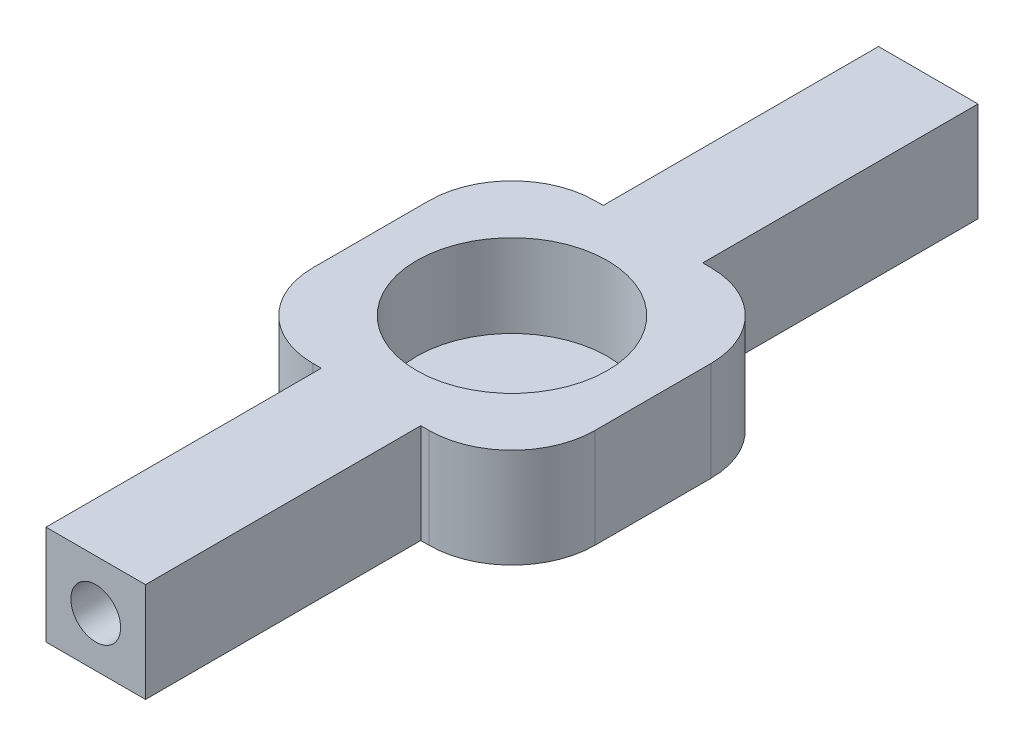
ISO-10303-21;
HEADER;
FILE_DESCRIPTION(('STEP AP214'),'2;1');
FILE_NAME('part.step','',(''),(''),'','','');
FILE_SCHEMA(('AUTOMOTIVE_DESIGN { 1 0 10303 214 1 1 1 1 }'));
ENDSEC;
DATA;
#1=APPLICATION_CONTEXT('core data for automotive mechanical design processes');
#2=APPLICATION_PROTOCOL_DEFINITION('international standard','automotive_design',2000,#1);
#3=PRODUCT_CONTEXT('',#1,'mechanical');
#4=PRODUCT('Part','Part','',(#3));
#5=PRODUCT_RELATED_PRODUCT_CATEGORY('part','',(#4));
#6=PRODUCT_DEFINITION_FORMATION('','',#4);
#7=PRODUCT_DEFINITION_CONTEXT('part definition',#1,'design');
#8=PRODUCT_DEFINITION('design','',#6,#7);
#9=PRODUCT_DEFINITION_SHAPE('','',#8);
#10=(LENGTH_UNIT() NAMED_UNIT(*) SI_UNIT(.MILLI.,.METRE.));
#11=(NAMED_UNIT(*) PLANE_ANGLE_UNIT() SI_UNIT($,.RADIAN.));
#12=(NAMED_UNIT(*) SI_UNIT($,.STERADIAN.) SOLID_ANGLE_UNIT());
#13=UNCERTAINTY_MEASURE_WITH_UNIT(LENGTH_MEASURE(1.E-05),#10,'distance_accuracy_value','');
#14=(GEOMETRIC_REPRESENTATION_CONTEXT(3) GLOBAL_UNCERTAINTY_ASSIGNED_CONTEXT((#13)) GLOBAL_UNIT_ASSIGNED_CONTEXT((#10,
#11,#12)) REPRESENTATION_CONTEXT('',''));
#15=CARTESIAN_POINT('',(0.,0.,0.));
#16=DIRECTION('',(0.,0.,1.));
#17=DIRECTION('',(1.,0.,0.));
#18=AXIS2_PLACEMENT_3D('',#15,#16,#17);
#19=CARTESIAN_POINT('',(0.,6.,0.));
#20=DIRECTION('',(0.,-1.,0.));
#21=DIRECTION('',(0.,0.,-1.));
#22=AXIS2_PLACEMENT_3D('',#19,#20,#21);
#23=PLANE('',#22);
#24=DIRECTION('',(-1.,0.,0.));
#25=VECTOR('',#24,1.);
#26=CARTESIAN_POINT('',(8.5,6.,8.5));
#27=LINE('',#26,#25);
#28=CARTESIAN_POINT('',(3.50000000000001,6.,8.5));
#29=VERTEX_POINT('',#28);
#30=CARTESIAN_POINT('',(3.,6.,8.5));
#31=VERTEX_POINT('',#30);
#32=EDGE_CURVE('E197',#29,#31,#27,.T.);
#33=ORIENTED_EDGE('',*,*,#32,.F.);
#34=CARTESIAN_POINT('',(3.5,6.,3.5));
#35=DIRECTION('',(0.,-1.,0.));
#36=DIRECTION('',(0.,0.,-1.));
#37=AXIS2_PLACEMENT_3D('',#34,#35,#36);
#38=CIRCLE('',#37,5.);
#39=CARTESIAN_POINT('',(8.5,6.,3.5));
#40=VERTEX_POINT('',#39);
#41=EDGE_CURVE('E270',#29,#40,#38,.F.);
#42=ORIENTED_EDGE('',*,*,#41,.T.);
#43=DIRECTION('',(0.,0.,1.));
#44=VECTOR('',#43,1.);
#45=CARTESIAN_POINT('',(8.5,6.,-8.5));
#46=LINE('',#45,#44);
#47=CARTESIAN_POINT('',(8.5,6.,-3.5));
#48=VERTEX_POINT('',#47);
#49=EDGE_CURVE('E209',#48,#40,#46,.T.);
#50=ORIENTED_EDGE('',*,*,#49,.F.);
#51=CARTESIAN_POINT('',(3.5,6.,-3.5));
#52=DIRECTION('',(0.,-1.,0.));
#53=DIRECTION('',(0.,0.,-1.));
#54=AXIS2_PLACEMENT_3D('',#51,#52,#53);
#55=CIRCLE('',#54,5.);
#56=CARTESIAN_POINT('',(3.5,6.,-8.5));
#57=VERTEX_POINT('',#56);
#58=EDGE_CURVE('E265',#48,#57,#55,.F.);
#59=ORIENTED_EDGE('',*,*,#58,.T.);
#60=DIRECTION('',(-1.,0.,0.));
#61=VECTOR('',#60,1.);
#62=CARTESIAN_POINT('',(8.5,6.,-8.5));
#63=LINE('',#62,#61);
#64=CARTESIAN_POINT('',(3.,6.,-8.5));
#65=VERTEX_POINT('',#64);
#66=EDGE_CURVE('E226',#57,#65,#63,.T.);
#67=ORIENTED_EDGE('',*,*,#66,.T.);
#68=DIRECTION('',(0.,0.,1.));
#69=VECTOR('',#68,1.);
#70=CARTESIAN_POINT('',(3.,6.,-25.1));
#71=LINE('',#70,#69);
#72=CARTESIAN_POINT('',(3.,6.,-25.1));
#73=VERTEX_POINT('',#72);
#74=EDGE_CURVE('E232',#73,#65,#71,.T.);
#75=ORIENTED_EDGE('',*,*,#74,.F.);
#76=DIRECTION('',(1.,0.,0.));
#77=VECTOR('',#76,1.);
#78=CARTESIAN_POINT('',(-3.,6.,-25.1));
#79=LINE('',#78,#77);
#80=CARTESIAN_POINT('',(-3.,6.,-25.1));
#81=VERTEX_POINT('',#80);
#82=EDGE_CURVE('E366',#81,#73,#79,.T.);
#83=ORIENTED_EDGE('',*,*,#82,.F.);
#84=DIRECTION('',(0.,0.,1.));
#85=VECTOR('',#84,1.);
#86=CARTESIAN_POINT('',(-3.,6.,-25.1));
#87=LINE('',#86,#85);
#88=CARTESIAN_POINT('',(-3.,6.,-8.5));
#89=VERTEX_POINT('',#88);
#90=EDGE_CURVE('E374',#81,#89,#87,.T.);
#91=ORIENTED_EDGE('',*,*,#90,.T.);
#92=DIRECTION('',(-1.,0.,0.));
#93=VECTOR('',#92,1.);
#94=CARTESIAN_POINT('',(-3.,6.,-8.5));
#95=LINE('',#94,#93);
#96=CARTESIAN_POINT('',(-3.5,6.,-8.5));
#97=VERTEX_POINT('',#96);
#98=EDGE_CURVE('E418',#89,#97,#95,.T.);
#99=ORIENTED_EDGE('',*,*,#98,.T.);
#100=CARTESIAN_POINT('',(-3.5,6.,-3.5));
#101=DIRECTION('',(0.,-1.,0.));
#102=DIRECTION('',(0.,0.,-1.));
#103=AXIS2_PLACEMENT_3D('',#100,#101,#102);
#104=CIRCLE('',#103,5.);
#105=CARTESIAN_POINT('',(-8.5,6.,-3.5));
#106=VERTEX_POINT('',#105);
#107=EDGE_CURVE('E262',#97,#106,#104,.F.);
#108=ORIENTED_EDGE('',*,*,#107,.T.);
#109=DIRECTION('',(0.,0.,1.));
#110=VECTOR('',#109,1.);
#111=CARTESIAN_POINT('',(-8.5,6.,-8.5));
#112=LINE('',#111,#110);
#113=CARTESIAN_POINT('',(-8.5,6.,3.5));
#114=VERTEX_POINT('',#113);
#115=EDGE_CURVE('E415',#106,#114,#112,.T.);
#116=ORIENTED_EDGE('',*,*,#115,.T.);
#117=CARTESIAN_POINT('',(-3.5,6.,3.5));
#118=DIRECTION('',(0.,-1.,0.));
#119=DIRECTION('',(0.,0.,-1.));
#120=AXIS2_PLACEMENT_3D('',#117,#118,#119);
#121=CIRCLE('',#120,5.);
#122=CARTESIAN_POINT('',(-3.49999999999999,6.,8.5));
#123=VERTEX_POINT('',#122);
#124=EDGE_CURVE('E97',#114,#123,#121,.F.);
#125=ORIENTED_EDGE('',*,*,#124,.T.);
#126=DIRECTION('',(-1.,0.,0.));
#127=VECTOR('',#126,1.);
#128=CARTESIAN_POINT('',(-3.,6.,8.5));
#129=LINE('',#128,#127);
#130=CARTESIAN_POINT('',(-3.,6.,8.5));
#131=VERTEX_POINT('',#130);
#132=EDGE_CURVE('E412',#131,#123,#129,.T.);
#133=ORIENTED_EDGE('',*,*,#132,.F.);
#134=DIRECTION('',(0.,0.,-1.));
#135=VECTOR('',#134,1.);
#136=CARTESIAN_POINT('',(-2.99999999999999,6.,25.1));
#137=LINE('',#136,#135);
#138=CARTESIAN_POINT('',(-2.99999999999999,6.,25.1));
#139=VERTEX_POINT('',#138);
#140=EDGE_CURVE('E409',#139,#131,#137,.T.);
#141=ORIENTED_EDGE('',*,*,#140,.F.);
#142=DIRECTION('',(1.,0.,0.));
#143=VECTOR('',#142,1.);
#144=CARTESIAN_POINT('',(-2.99999999999999,6.,25.1));
#145=LINE('',#144,#143);
#146=CARTESIAN_POINT('',(2.99999999999999,6.,25.1));
#147=VERTEX_POINT('',#146);
#148=EDGE_CURVE('E215',#139,#147,#145,.T.);
#149=ORIENTED_EDGE('',*,*,#148,.T.);
#150=DIRECTION('',(0.,0.,-1.));
#151=VECTOR('',#150,1.);
#152=CARTESIAN_POINT('',(2.99999999999999,6.,25.1));
#153=LINE('',#152,#151);
#154=EDGE_CURVE('E208',#147,#31,#153,.T.);
#155=ORIENTED_EDGE('',*,*,#154,.T.);
#156=EDGE_LOOP('',(#33,#42,#50,#59,#67,#75,#83,#91,#99,#108,#116,#125,#133,#141,#149,#155));
#157=FACE_BOUND('',#156,.T.);
#158=CARTESIAN_POINT('',(0.,6.,0.));
#159=DIRECTION('',(0.,1.,0.));
#160=DIRECTION('',(0.,0.,1.));
#161=AXIS2_PLACEMENT_3D('',#158,#159,#160);
#162=CIRCLE('',#161,5.75);
#163=CARTESIAN_POINT('',(0.,6.,5.75));
#164=VERTEX_POINT('',#163);
#165=EDGE_CURVE('E382',#164,#164,#162,.T.);
#166=ORIENTED_EDGE('',*,*,#165,.F.);
#167=EDGE_LOOP('',(#166));
#168=FACE_BOUND('',#167,.T.);
#169=ADVANCED_FACE('F81',(#157,#168),#23,.F.);
#170=CARTESIAN_POINT('',(0.,0.,0.));
#171=DIRECTION('',(0.,-1.,0.));
#172=DIRECTION('',(0.,0.,-1.));
#173=AXIS2_PLACEMENT_3D('',#170,#171,#172);
#174=PLANE('',#173);
#175=DIRECTION('',(0.,0.,1.));
#176=VECTOR('',#175,1.);
#177=CARTESIAN_POINT('',(8.5,0.,-8.5));
#178=LINE('',#177,#176);
#179=CARTESIAN_POINT('',(8.5,0.,-3.5));
#180=VERTEX_POINT('',#179);
#181=CARTESIAN_POINT('',(8.5,0.,3.5));
#182=VERTEX_POINT('',#181);
#183=EDGE_CURVE('E378',#180,#182,#178,.T.);
#184=ORIENTED_EDGE('',*,*,#183,.T.);
#185=CARTESIAN_POINT('',(3.5,0.,3.5));
#186=DIRECTION('',(0.,-1.,0.));
#187=DIRECTION('',(0.,0.,-1.));
#188=AXIS2_PLACEMENT_3D('',#185,#186,#187);
#189=CIRCLE('',#188,5.);
#190=CARTESIAN_POINT('',(3.50000000000001,0.,8.5));
#191=VERTEX_POINT('',#190);
#192=EDGE_CURVE('E257',#182,#191,#189,.T.);
#193=ORIENTED_EDGE('',*,*,#192,.T.);
#194=DIRECTION('',(-1.,0.,0.));
#195=VECTOR('',#194,1.);
#196=CARTESIAN_POINT('',(8.5,0.,8.5));
#197=LINE('',#196,#195);
#198=CARTESIAN_POINT('',(3.,0.,8.5));
#199=VERTEX_POINT('',#198);
#200=EDGE_CURVE('E381',#191,#199,#197,.T.);
#201=ORIENTED_EDGE('',*,*,#200,.T.);
#202=DIRECTION('',(0.,0.,-1.));
#203=VECTOR('',#202,1.);
#204=CARTESIAN_POINT('',(2.99999999999999,0.,25.1));
#205=LINE('',#204,#203);
#206=CARTESIAN_POINT('',(2.99999999999999,0.,25.1));
#207=VERTEX_POINT('',#206);
#208=EDGE_CURVE('E223',#207,#199,#205,.T.);
#209=ORIENTED_EDGE('',*,*,#208,.F.);
#210=DIRECTION('',(1.,0.,0.));
#211=VECTOR('',#210,1.);
#212=CARTESIAN_POINT('',(-2.99999999999999,0.,25.1));
#213=LINE('',#212,#211);
#214=CARTESIAN_POINT('',(-2.99999999999999,0.,25.1));
#215=VERTEX_POINT('',#214);
#216=EDGE_CURVE('E329',#215,#207,#213,.T.);
#217=ORIENTED_EDGE('',*,*,#216,.F.);
#218=DIRECTION('',(0.,0.,-1.));
#219=VECTOR('',#218,1.);
#220=CARTESIAN_POINT('',(-2.99999999999999,0.,25.1));
#221=LINE('',#220,#219);
#222=CARTESIAN_POINT('',(-3.,0.,8.5));
#223=VERTEX_POINT('',#222);
#224=EDGE_CURVE('E335',#215,#223,#221,.T.);
#225=ORIENTED_EDGE('',*,*,#224,.T.);
#226=DIRECTION('',(-1.,0.,0.));
#227=VECTOR('',#226,1.);
#228=CARTESIAN_POINT('',(-3.,0.,8.5));
#229=LINE('',#228,#227);
#230=CARTESIAN_POINT('',(-3.49999999999999,0.,8.5));
#231=VERTEX_POINT('',#230);
#232=EDGE_CURVE('E341',#223,#231,#229,.T.);
#233=ORIENTED_EDGE('',*,*,#232,.T.);
#234=CARTESIAN_POINT('',(-3.5,0.,3.5));
#235=DIRECTION('',(0.,-1.,0.));
#236=DIRECTION('',(0.,0.,-1.));
#237=AXIS2_PLACEMENT_3D('',#234,#235,#236);
#238=CIRCLE('',#237,5.);
#239=CARTESIAN_POINT('',(-8.5,0.,3.5));
#240=VERTEX_POINT('',#239);
#241=EDGE_CURVE('E254',#231,#240,#238,.T.);
#242=ORIENTED_EDGE('',*,*,#241,.T.);
#243=DIRECTION('',(0.,0.,1.));
#244=VECTOR('',#243,1.);
#245=CARTESIAN_POINT('',(-8.5,0.,-8.5));
#246=LINE('',#245,#244);
#247=CARTESIAN_POINT('',(-8.5,0.,-3.5));
#248=VERTEX_POINT('',#247);
#249=EDGE_CURVE('E344',#248,#240,#246,.T.);
#250=ORIENTED_EDGE('',*,*,#249,.F.);
#251=CARTESIAN_POINT('',(-3.5,0.,-3.5));
#252=DIRECTION('',(0.,-1.,0.));
#253=DIRECTION('',(0.,0.,-1.));
#254=AXIS2_PLACEMENT_3D('',#251,#252,#253);
#255=CIRCLE('',#254,5.);
#256=CARTESIAN_POINT('',(-3.5,0.,-8.5));
#257=VERTEX_POINT('',#256);
#258=EDGE_CURVE('E248',#248,#257,#255,.T.);
#259=ORIENTED_EDGE('',*,*,#258,.T.);
#260=DIRECTION('',(-1.,0.,0.));
#261=VECTOR('',#260,1.);
#262=CARTESIAN_POINT('',(-3.,0.,-8.5));
#263=LINE('',#262,#261);
#264=CARTESIAN_POINT('',(-3.,0.,-8.5));
#265=VERTEX_POINT('',#264);
#266=EDGE_CURVE('E350',#265,#257,#263,.T.);
#267=ORIENTED_EDGE('',*,*,#266,.F.);
#268=DIRECTION('',(0.,0.,1.));
#269=VECTOR('',#268,1.);
#270=CARTESIAN_POINT('',(-3.,0.,-25.1));
#271=LINE('',#270,#269);
#272=CARTESIAN_POINT('',(-3.,0.,-25.1));
#273=VERTEX_POINT('',#272);
#274=EDGE_CURVE('E354',#273,#265,#271,.T.);
#275=ORIENTED_EDGE('',*,*,#274,.F.);
#276=DIRECTION('',(1.,0.,0.));
#277=VECTOR('',#276,1.);
#278=CARTESIAN_POINT('',(-3.,0.,-25.1));
#279=LINE('',#278,#277);
#280=CARTESIAN_POINT('',(3.,0.,-25.1));
#281=VERTEX_POINT('',#280);
#282=EDGE_CURVE('E308',#273,#281,#279,.T.);
#283=ORIENTED_EDGE('',*,*,#282,.T.);
#284=DIRECTION('',(0.,0.,1.));
#285=VECTOR('',#284,1.);
#286=CARTESIAN_POINT('',(3.,0.,-25.1));
#287=LINE('',#286,#285);
#288=CARTESIAN_POINT('',(3.,0.,-8.5));
#289=VERTEX_POINT('',#288);
#290=EDGE_CURVE('E301',#281,#289,#287,.T.);
#291=ORIENTED_EDGE('',*,*,#290,.T.);
#292=DIRECTION('',(-1.,0.,0.));
#293=VECTOR('',#292,1.);
#294=CARTESIAN_POINT('',(8.5,0.,-8.5));
#295=LINE('',#294,#293);
#296=CARTESIAN_POINT('',(3.5,0.,-8.5));
#297=VERTEX_POINT('',#296);
#298=EDGE_CURVE('E290',#297,#289,#295,.T.);
#299=ORIENTED_EDGE('',*,*,#298,.F.);
#300=CARTESIAN_POINT('',(3.5,0.,-3.5));
#301=DIRECTION('',(0.,-1.,0.));
#302=DIRECTION('',(0.,0.,-1.));
#303=AXIS2_PLACEMENT_3D('',#300,#301,#302);
#304=CIRCLE('',#303,5.);
#305=EDGE_CURVE('E251',#297,#180,#304,.T.);
#306=ORIENTED_EDGE('',*,*,#305,.T.);
#307=EDGE_LOOP('',(#184,#193,#201,#209,#217,#225,#233,#242,#250,#259,#267,#275,#283,#291,#299,#306));
#308=FACE_BOUND('',#307,.T.);
#309=ADVANCED_FACE('F297',(#308),#174,.T.);
#310=CARTESIAN_POINT('',(8.5,6.,-8.5));
#311=DIRECTION('',(1.,0.,0.));
#312=DIRECTION('',(0.,0.,-1.));
#313=AXIS2_PLACEMENT_3D('',#310,#311,#312);
#314=PLANE('',#313);
#315=ORIENTED_EDGE('',*,*,#49,.T.);
#316=DIRECTION('',(0.,-1.,0.));
#317=VECTOR('',#316,1.);
#318=CARTESIAN_POINT('',(8.5,6.,3.5));
#319=LINE('',#318,#317);
#320=EDGE_CURVE('E244',#40,#182,#319,.T.);
#321=ORIENTED_EDGE('',*,*,#320,.T.);
#322=ORIENTED_EDGE('',*,*,#183,.F.);
#323=DIRECTION('',(0.,-1.,0.));
#324=VECTOR('',#323,1.);
#325=CARTESIAN_POINT('',(8.5,6.,-3.5));
#326=LINE('',#325,#324);
#327=EDGE_CURVE('E240',#180,#48,#326,.F.);
#328=ORIENTED_EDGE('',*,*,#327,.T.);
#329=EDGE_LOOP('',(#315,#321,#322,#328));
#330=FACE_BOUND('',#329,.T.);
#331=ADVANCED_FACE('F452',(#330),#314,.T.);
#332=CARTESIAN_POINT('',(8.5,6.,-8.5));
#333=DIRECTION('',(0.,0.,1.));
#334=DIRECTION('',(1.,0.,0.));
#335=AXIS2_PLACEMENT_3D('',#332,#333,#334);
#336=PLANE('',#335);
#337=ORIENTED_EDGE('',*,*,#66,.F.);
#338=DIRECTION('',(0.,-1.,0.));
#339=VECTOR('',#338,1.);
#340=CARTESIAN_POINT('',(3.5,0.,-8.5));
#341=LINE('',#340,#339);
#342=EDGE_CURVE('E90',#57,#297,#341,.T.);
#343=ORIENTED_EDGE('',*,*,#342,.T.);
#344=ORIENTED_EDGE('',*,*,#298,.T.);
#345=DIRECTION('',(0.,-1.,0.));
#346=VECTOR('',#345,1.);
#347=CARTESIAN_POINT('',(3.,6.,-8.5));
#348=LINE('',#347,#346);
#349=EDGE_CURVE('E241',#65,#289,#348,.T.);
#350=ORIENTED_EDGE('',*,*,#349,.F.);
#351=EDGE_LOOP('',(#337,#343,#344,#350));
#352=FACE_BOUND('',#351,.T.);
#353=ADVANCED_FACE('F288',(#352),#336,.F.);
#354=CARTESIAN_POINT('',(3.,6.,-25.1));
#355=DIRECTION('',(1.,0.,0.));
#356=DIRECTION('',(0.,0.,-1.));
#357=AXIS2_PLACEMENT_3D('',#354,#355,#356);
#358=PLANE('',#357);
#359=ORIENTED_EDGE('',*,*,#290,.F.);
#360=DIRECTION('',(0.,-1.,0.));
#361=VECTOR('',#360,1.);
#362=CARTESIAN_POINT('',(3.,6.,-25.1));
#363=LINE('',#362,#361);
#364=EDGE_CURVE('E314',#73,#281,#363,.T.);
#365=ORIENTED_EDGE('',*,*,#364,.F.);
#366=ORIENTED_EDGE('',*,*,#74,.T.);
#367=ORIENTED_EDGE('',*,*,#349,.T.);
#368=EDGE_LOOP('',(#359,#365,#366,#367));
#369=FACE_BOUND('',#368,.T.);
#370=ADVANCED_FACE('F370',(#369),#358,.T.);
#371=CARTESIAN_POINT('',(-3.,6.,-25.1));
#372=DIRECTION('',(0.,0.,-1.));
#373=DIRECTION('',(-1.,0.,0.));
#374=AXIS2_PLACEMENT_3D('',#371,#372,#373);
#375=PLANE('',#374);
#376=CARTESIAN_POINT('',(0.,3.,-25.1));
#377=DIRECTION('',(0.,0.,-1.));
#378=DIRECTION('',(-1.,0.,0.));
#379=AXIS2_PLACEMENT_3D('',#376,#377,#378);
#380=CIRCLE('',#379,1.5);
#381=CARTESIAN_POINT('',(-1.5,3.,-25.1));
#382=VERTEX_POINT('',#381);
#383=EDGE_CURVE('E392',#382,#382,#380,.T.);
#384=ORIENTED_EDGE('',*,*,#383,.F.);
#385=EDGE_LOOP('',(#384));
#386=FACE_BOUND('',#385,.T.);
#387=ORIENTED_EDGE('',*,*,#282,.F.);
#388=DIRECTION('',(0.,-1.,0.));
#389=VECTOR('',#388,1.);
#390=CARTESIAN_POINT('',(-3.,6.,-25.1));
#391=LINE('',#390,#389);
#392=EDGE_CURVE('E317',#81,#273,#391,.T.);
#393=ORIENTED_EDGE('',*,*,#392,.F.);
#394=ORIENTED_EDGE('',*,*,#82,.T.);
#395=ORIENTED_EDGE('',*,*,#364,.T.);
#396=EDGE_LOOP('',(#387,#393,#394,#395));
#397=FACE_BOUND('',#396,.T.);
#398=ADVANCED_FACE('F362',(#386,#397),#375,.T.);
#399=CARTESIAN_POINT('',(-3.,6.,-25.1));
#400=DIRECTION('',(1.,0.,0.));
#401=DIRECTION('',(0.,0.,-1.));
#402=AXIS2_PLACEMENT_3D('',#399,#400,#401);
#403=PLANE('',#402);
#404=ORIENTED_EDGE('',*,*,#274,.T.);
#405=DIRECTION('',(0.,-1.,0.));
#406=VECTOR('',#405,1.);
#407=CARTESIAN_POINT('',(-3.,6.,-8.5));
#408=LINE('',#407,#406);
#409=EDGE_CURVE('E320',#89,#265,#408,.T.);
#410=ORIENTED_EDGE('',*,*,#409,.F.);
#411=ORIENTED_EDGE('',*,*,#90,.F.);
#412=ORIENTED_EDGE('',*,*,#392,.T.);
#413=EDGE_LOOP('',(#404,#410,#411,#412));
#414=FACE_BOUND('',#413,.T.);
#415=ADVANCED_FACE('F426',(#414),#403,.F.);
#416=CARTESIAN_POINT('',(-3.,6.,-8.5));
#417=DIRECTION('',(0.,0.,1.));
#418=DIRECTION('',(1.,0.,0.));
#419=AXIS2_PLACEMENT_3D('',#416,#417,#418);
#420=PLANE('',#419);
#421=ORIENTED_EDGE('',*,*,#266,.T.);
#422=DIRECTION('',(0.,-1.,0.));
#423=VECTOR('',#422,1.);
#424=CARTESIAN_POINT('',(-3.5,6.,-8.5));
#425=LINE('',#424,#423);
#426=EDGE_CURVE('E12',#257,#97,#425,.F.);
#427=ORIENTED_EDGE('',*,*,#426,.T.);
#428=ORIENTED_EDGE('',*,*,#98,.F.);
#429=ORIENTED_EDGE('',*,*,#409,.T.);
#430=EDGE_LOOP('',(#421,#427,#428,#429));
#431=FACE_BOUND('',#430,.T.);
#432=ADVANCED_FACE('F428',(#431),#420,.F.);
#433=CARTESIAN_POINT('',(-8.5,6.,-8.5));
#434=DIRECTION('',(1.,0.,0.));
#435=DIRECTION('',(0.,0.,-1.));
#436=AXIS2_PLACEMENT_3D('',#433,#434,#435);
#437=PLANE('',#436);
#438=ORIENTED_EDGE('',*,*,#249,.T.);
#439=DIRECTION('',(0.,-1.,0.));
#440=VECTOR('',#439,1.);
#441=CARTESIAN_POINT('',(-8.5,6.,3.5));
#442=LINE('',#441,#440);
#443=EDGE_CURVE('E105',#240,#114,#442,.F.);
#444=ORIENTED_EDGE('',*,*,#443,.T.);
#445=ORIENTED_EDGE('',*,*,#115,.F.);
#446=DIRECTION('',(0.,-1.,0.));
#447=VECTOR('',#446,1.);
#448=CARTESIAN_POINT('',(-8.5,6.,-3.5));
#449=LINE('',#448,#447);
#450=EDGE_CURVE('E277',#106,#248,#449,.T.);
#451=ORIENTED_EDGE('',*,*,#450,.T.);
#452=EDGE_LOOP('',(#438,#444,#445,#451));
#453=FACE_BOUND('',#452,.T.);
#454=ADVANCED_FACE('F432',(#453),#437,.F.);
#455=CARTESIAN_POINT('',(-3.,6.,8.5));
#456=DIRECTION('',(0.,0.,1.));
#457=DIRECTION('',(1.,0.,0.));
#458=AXIS2_PLACEMENT_3D('',#455,#456,#457);
#459=PLANE('',#458);
#460=ORIENTED_EDGE('',*,*,#132,.T.);
#461=DIRECTION('',(0.,-1.,0.));
#462=VECTOR('',#461,1.);
#463=CARTESIAN_POINT('',(-3.49999999999999,0.,8.5));
#464=LINE('',#463,#462);
#465=EDGE_CURVE('E273',#123,#231,#464,.T.);
#466=ORIENTED_EDGE('',*,*,#465,.T.);
#467=ORIENTED_EDGE('',*,*,#232,.F.);
#468=DIRECTION('',(0.,-1.,0.));
#469=VECTOR('',#468,1.);
#470=CARTESIAN_POINT('',(-3.,6.,8.5));
#471=LINE('',#470,#469);
#472=EDGE_CURVE('E323',#131,#223,#471,.T.);
#473=ORIENTED_EDGE('',*,*,#472,.F.);
#474=EDGE_LOOP('',(#460,#466,#467,#473));
#475=FACE_BOUND('',#474,.T.);
#476=ADVANCED_FACE('F438',(#475),#459,.T.);
#477=CARTESIAN_POINT('',(-2.99999999999999,6.,25.1));
#478=DIRECTION('',(-1.,0.,0.));
#479=DIRECTION('',(0.,0.,1.));
#480=AXIS2_PLACEMENT_3D('',#477,#478,#479);
#481=PLANE('',#480);
#482=ORIENTED_EDGE('',*,*,#224,.F.);
#483=DIRECTION('',(0.,-1.,0.));
#484=VECTOR('',#483,1.);
#485=CARTESIAN_POINT('',(-2.99999999999999,6.,25.1));
#486=LINE('',#485,#484);
#487=EDGE_CURVE('E230',#139,#215,#486,.T.);
#488=ORIENTED_EDGE('',*,*,#487,.F.);
#489=ORIENTED_EDGE('',*,*,#140,.T.);
#490=ORIENTED_EDGE('',*,*,#472,.T.);
#491=EDGE_LOOP('',(#482,#488,#489,#490));
#492=FACE_BOUND('',#491,.T.);
#493=ADVANCED_FACE('F338',(#492),#481,.T.);
#494=CARTESIAN_POINT('',(-2.99999999999999,6.,25.1));
#495=DIRECTION('',(0.,0.,-1.));
#496=DIRECTION('',(-1.,0.,0.));
#497=AXIS2_PLACEMENT_3D('',#494,#495,#496);
#498=PLANE('',#497);
#499=CARTESIAN_POINT('',(0.,3.,25.1));
#500=DIRECTION('',(0.,0.,1.));
#501=DIRECTION('',(1.,0.,0.));
#502=AXIS2_PLACEMENT_3D('',#499,#500,#501);
#503=CIRCLE('',#502,1.5);
#504=CARTESIAN_POINT('',(1.5,3.,25.1));
#505=VERTEX_POINT('',#504);
#506=EDGE_CURVE('E400',#505,#505,#503,.T.);
#507=ORIENTED_EDGE('',*,*,#506,.F.);
#508=EDGE_LOOP('',(#507));
#509=FACE_BOUND('',#508,.T.);
#510=ORIENTED_EDGE('',*,*,#216,.T.);
#511=DIRECTION('',(0.,-1.,0.));
#512=VECTOR('',#511,1.);
#513=CARTESIAN_POINT('',(2.99999999999999,6.,25.1));
#514=LINE('',#513,#512);
#515=EDGE_CURVE('E225',#147,#207,#514,.T.);
#516=ORIENTED_EDGE('',*,*,#515,.F.);
#517=ORIENTED_EDGE('',*,*,#148,.F.);
#518=ORIENTED_EDGE('',*,*,#487,.T.);
#519=EDGE_LOOP('',(#510,#516,#517,#518));
#520=FACE_BOUND('',#519,.T.);
#521=ADVANCED_FACE('F328',(#509,#520),#498,.F.);
#522=CARTESIAN_POINT('',(2.99999999999999,6.,25.1));
#523=DIRECTION('',(-1.,0.,0.));
#524=DIRECTION('',(0.,0.,1.));
#525=AXIS2_PLACEMENT_3D('',#522,#523,#524);
#526=PLANE('',#525);
#527=ORIENTED_EDGE('',*,*,#208,.T.);
#528=DIRECTION('',(0.,-1.,0.));
#529=VECTOR('',#528,1.);
#530=CARTESIAN_POINT('',(3.,6.,8.5));
#531=LINE('',#530,#529);
#532=EDGE_CURVE('E202',#31,#199,#531,.T.);
#533=ORIENTED_EDGE('',*,*,#532,.F.);
#534=ORIENTED_EDGE('',*,*,#154,.F.);
#535=ORIENTED_EDGE('',*,*,#515,.T.);
#536=EDGE_LOOP('',(#527,#533,#534,#535));
#537=FACE_BOUND('',#536,.T.);
#538=ADVANCED_FACE('F221',(#537),#526,.F.);
#539=CARTESIAN_POINT('',(8.5,6.,8.5));
#540=DIRECTION('',(0.,0.,1.));
#541=DIRECTION('',(1.,0.,0.));
#542=AXIS2_PLACEMENT_3D('',#539,#540,#541);
#543=PLANE('',#542);
#544=ORIENTED_EDGE('',*,*,#200,.F.);
#545=DIRECTION('',(0.,-1.,0.));
#546=VECTOR('',#545,1.);
#547=CARTESIAN_POINT('',(3.50000000000001,6.,8.5));
#548=LINE('',#547,#546);
#549=EDGE_CURVE('E205',#191,#29,#548,.F.);
#550=ORIENTED_EDGE('',*,*,#549,.T.);
#551=ORIENTED_EDGE('',*,*,#32,.T.);
#552=ORIENTED_EDGE('',*,*,#532,.T.);
#553=EDGE_LOOP('',(#544,#550,#551,#552));
#554=FACE_BOUND('',#553,.T.);
#555=ADVANCED_FACE('F200',(#554),#543,.T.);
#556=CARTESIAN_POINT('',(0.,6.,0.));
#557=DIRECTION('',(0.,-1.,0.));
#558=DIRECTION('',(0.,0.,-1.));
#559=AXIS2_PLACEMENT_3D('',#556,#557,#558);
#560=CYLINDRICAL_SURFACE('',#559,5.75);
#561=CARTESIAN_POINT('',(0.,1.,0.));
#562=DIRECTION('',(0.,1.,0.));
#563=DIRECTION('',(0.,0.,1.));
#564=AXIS2_PLACEMENT_3D('',#561,#562,#563);
#565=CIRCLE('',#564,5.75);
#566=CARTESIAN_POINT('',(0.,1.,5.75));
#567=VERTEX_POINT('',#566);
#568=EDGE_CURVE('E236',#567,#567,#565,.T.);
#569=ORIENTED_EDGE('',*,*,#568,.F.);
#570=EDGE_LOOP('',(#569));
#571=FACE_BOUND('',#570,.T.);
#572=ORIENTED_EDGE('',*,*,#165,.T.);
#573=EDGE_LOOP('',(#572));
#574=FACE_BOUND('',#573,.T.);
#575=ADVANCED_FACE('F455',(#571,#574),#560,.F.);
#576=CARTESIAN_POINT('',(0.,1.,0.));
#577=DIRECTION('',(0.,1.,0.));
#578=DIRECTION('',(0.,0.,1.));
#579=AXIS2_PLACEMENT_3D('',#576,#577,#578);
#580=PLANE('',#579);
#581=ORIENTED_EDGE('',*,*,#568,.T.);
#582=EDGE_LOOP('',(#581));
#583=FACE_BOUND('',#582,.T.);
#584=ADVANCED_FACE('F507',(#583),#580,.T.);
#585=CARTESIAN_POINT('',(3.5,6.,3.5));
#586=DIRECTION('',(0.,-1.,0.));
#587=DIRECTION('',(0.,0.,-1.));
#588=AXIS2_PLACEMENT_3D('',#585,#586,#587);
#589=CYLINDRICAL_SURFACE('',#588,5.);
#590=ORIENTED_EDGE('',*,*,#41,.F.);
#591=ORIENTED_EDGE('',*,*,#549,.F.);
#592=ORIENTED_EDGE('',*,*,#192,.F.);
#593=ORIENTED_EDGE('',*,*,#320,.F.);
#594=EDGE_LOOP('',(#590,#591,#592,#593));
#595=FACE_BOUND('',#594,.T.);
#596=ADVANCED_FACE('F502',(#595),#589,.T.);
#597=CARTESIAN_POINT('',(-3.5,6.,3.5));
#598=DIRECTION('',(0.,1.,0.));
#599=DIRECTION('',(0.,0.,1.));
#600=AXIS2_PLACEMENT_3D('',#597,#598,#599);
#601=CYLINDRICAL_SURFACE('',#600,5.);
#602=ORIENTED_EDGE('',*,*,#124,.F.);
#603=ORIENTED_EDGE('',*,*,#443,.F.);
#604=ORIENTED_EDGE('',*,*,#241,.F.);
#605=ORIENTED_EDGE('',*,*,#465,.F.);
#606=EDGE_LOOP('',(#602,#603,#604,#605));
#607=FACE_BOUND('',#606,.T.);
#608=ADVANCED_FACE('F436',(#607),#601,.T.);
#609=CARTESIAN_POINT('',(3.5,6.,-3.5));
#610=DIRECTION('',(0.,1.,0.));
#611=DIRECTION('',(0.,0.,1.));
#612=AXIS2_PLACEMENT_3D('',#609,#610,#611);
#613=CYLINDRICAL_SURFACE('',#612,5.);
#614=ORIENTED_EDGE('',*,*,#58,.F.);
#615=ORIENTED_EDGE('',*,*,#327,.F.);
#616=ORIENTED_EDGE('',*,*,#305,.F.);
#617=ORIENTED_EDGE('',*,*,#342,.F.);
#618=EDGE_LOOP('',(#614,#615,#616,#617));
#619=FACE_BOUND('',#618,.T.);
#620=ADVANCED_FACE('F520',(#619),#613,.T.);
#621=CARTESIAN_POINT('',(-3.5,6.,-3.5));
#622=DIRECTION('',(0.,-1.,0.));
#623=DIRECTION('',(0.,0.,-1.));
#624=AXIS2_PLACEMENT_3D('',#621,#622,#623);
#625=CYLINDRICAL_SURFACE('',#624,5.);
#626=ORIENTED_EDGE('',*,*,#107,.F.);
#627=ORIENTED_EDGE('',*,*,#426,.F.);
#628=ORIENTED_EDGE('',*,*,#258,.F.);
#629=ORIENTED_EDGE('',*,*,#450,.F.);
#630=EDGE_LOOP('',(#626,#627,#628,#629));
#631=FACE_BOUND('',#630,.T.);
#632=ADVANCED_FACE('F83',(#631),#625,.T.);
#633=CARTESIAN_POINT('',(0.,3.,-20.1));
#634=DIRECTION('',(0.,0.,-1.));
#635=DIRECTION('',(-1.,0.,0.));
#636=AXIS2_PLACEMENT_3D('',#633,#634,#635);
#637=CYLINDRICAL_SURFACE('',#636,1.5);
#638=CARTESIAN_POINT('',(0.,3.,-20.1));
#639=DIRECTION('',(0.,0.,-1.));
#640=DIRECTION('',(-1.,0.,0.));
#641=AXIS2_PLACEMENT_3D('',#638,#639,#640);
#642=CIRCLE('',#641,1.5);
#643=CARTESIAN_POINT('',(-1.5,3.,-20.1));
#644=VERTEX_POINT('',#643);
#645=EDGE_CURVE('E388',#644,#644,#642,.T.);
#646=ORIENTED_EDGE('',*,*,#645,.F.);
#647=EDGE_LOOP('',(#646));
#648=FACE_BOUND('',#647,.T.);
#649=ORIENTED_EDGE('',*,*,#383,.T.);
#650=EDGE_LOOP('',(#649));
#651=FACE_BOUND('',#650,.T.);
#652=ADVANCED_FACE('F538',(#648,#651),#637,.F.);
#653=CARTESIAN_POINT('',(0.,3.,-20.1));
#654=DIRECTION('',(0.,0.,-1.));
#655=DIRECTION('',(-1.,0.,0.));
#656=AXIS2_PLACEMENT_3D('',#653,#654,#655);
#657=PLANE('',#656);
#658=ORIENTED_EDGE('',*,*,#645,.T.);
#659=EDGE_LOOP('',(#658));
#660=FACE_BOUND('',#659,.T.);
#661=ADVANCED_FACE('F556',(#660),#657,.T.);
#662=CARTESIAN_POINT('',(0.,3.,20.1));
#663=DIRECTION('',(0.,0.,1.));
#664=DIRECTION('',(1.,0.,0.));
#665=AXIS2_PLACEMENT_3D('',#662,#663,#664);
#666=CYLINDRICAL_SURFACE('',#665,1.5);
#667=CARTESIAN_POINT('',(0.,3.,20.1));
#668=DIRECTION('',(0.,0.,1.));
#669=DIRECTION('',(1.,0.,0.));
#670=AXIS2_PLACEMENT_3D('',#667,#668,#669);
#671=CIRCLE('',#670,1.5);
#672=CARTESIAN_POINT('',(1.5,3.,20.1));
#673=VERTEX_POINT('',#672);
#674=EDGE_CURVE('E396',#673,#673,#671,.T.);
#675=ORIENTED_EDGE('',*,*,#674,.F.);
#676=EDGE_LOOP('',(#675));
#677=FACE_BOUND('',#676,.T.);
#678=ORIENTED_EDGE('',*,*,#506,.T.);
#679=EDGE_LOOP('',(#678));
#680=FACE_BOUND('',#679,.T.);
#681=ADVANCED_FACE('F567',(#677,#680),#666,.F.);
#682=CARTESIAN_POINT('',(0.,3.,20.1));
#683=DIRECTION('',(0.,0.,1.));
#684=DIRECTION('',(1.,0.,0.));
#685=AXIS2_PLACEMENT_3D('',#682,#683,#684);
#686=PLANE('',#685);
#687=ORIENTED_EDGE('',*,*,#674,.T.);
#688=EDGE_LOOP('',(#687));
#689=FACE_BOUND('',#688,.T.);
#690=ADVANCED_FACE('F588',(#689),#686,.T.);
#691=CLOSED_SHELL('',(#169,#309,#331,#353,#370,#398,#415,#432,#454,#476,#493,#521,#538,#555,
#575,#584,#596,#608,#620,#632,#652,#661,#681,#690));
#692=MANIFOLD_SOLID_BREP('B2',#691);
#693=ADVANCED_BREP_SHAPE_REPRESENTATION('',(#18,#692),#14);
#694=SHAPE_DEFINITION_REPRESENTATION(#9,#693);
ENDSEC;
END-ISO-10303-21;
